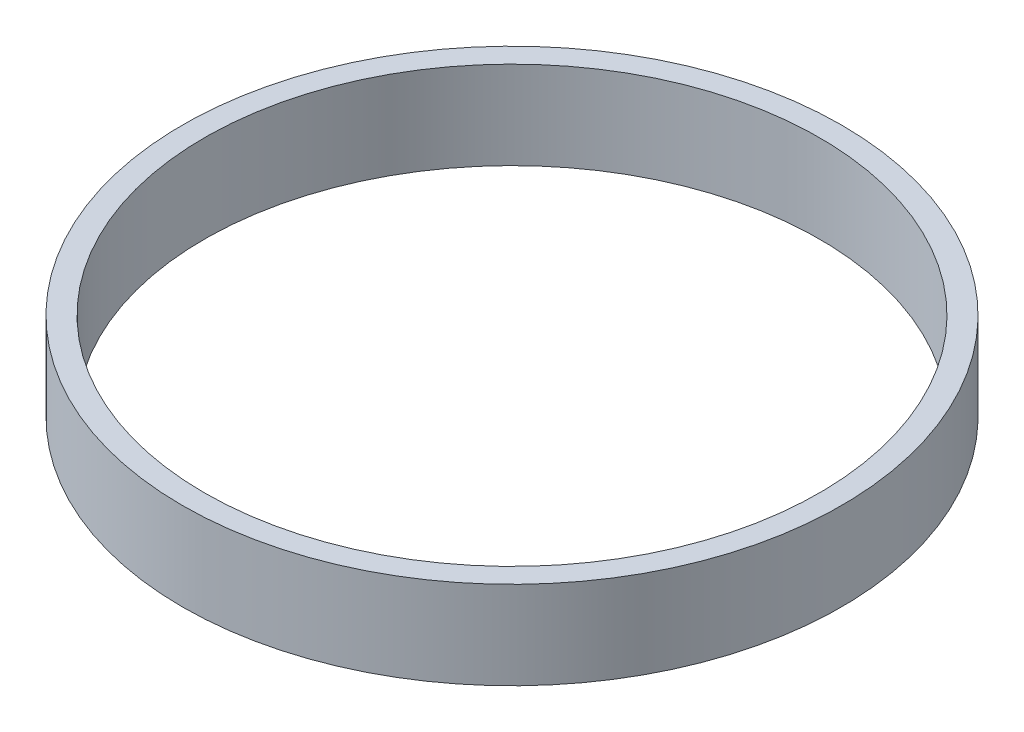
ISO-10303-21;
HEADER;
FILE_DESCRIPTION(('STEP AP214'),'2;1');
FILE_NAME('part.step','',(''),(''),'','','');
FILE_SCHEMA(('AUTOMOTIVE_DESIGN { 1 0 10303 214 1 1 1 1 }'));
ENDSEC;
DATA;
#1=APPLICATION_CONTEXT('core data for automotive mechanical design processes');
#2=APPLICATION_PROTOCOL_DEFINITION('international standard','automotive_design',2000,#1);
#3=PRODUCT_CONTEXT('',#1,'mechanical');
#4=PRODUCT('Part','Part','',(#3));
#5=PRODUCT_RELATED_PRODUCT_CATEGORY('part','',(#4));
#6=PRODUCT_DEFINITION_FORMATION('','',#4);
#7=PRODUCT_DEFINITION_CONTEXT('part definition',#1,'design');
#8=PRODUCT_DEFINITION('design','',#6,#7);
#9=PRODUCT_DEFINITION_SHAPE('','',#8);
#10=(LENGTH_UNIT() NAMED_UNIT(*) SI_UNIT(.MILLI.,.METRE.));
#11=(NAMED_UNIT(*) PLANE_ANGLE_UNIT() SI_UNIT($,.RADIAN.));
#12=(NAMED_UNIT(*) SI_UNIT($,.STERADIAN.) SOLID_ANGLE_UNIT());
#13=UNCERTAINTY_MEASURE_WITH_UNIT(LENGTH_MEASURE(1.E-05),#10,'distance_accuracy_value','');
#14=(GEOMETRIC_REPRESENTATION_CONTEXT(3) GLOBAL_UNCERTAINTY_ASSIGNED_CONTEXT((#13)) GLOBAL_UNIT_ASSIGNED_CONTEXT((#10,
#11,#12)) REPRESENTATION_CONTEXT('',''));
#15=CARTESIAN_POINT('',(0.,0.,0.));
#16=DIRECTION('',(0.,0.,1.));
#17=DIRECTION('',(1.,0.,0.));
#18=AXIS2_PLACEMENT_3D('',#15,#16,#17);
#19=CARTESIAN_POINT('',(0.,10.,0.));
#20=DIRECTION('',(0.,1.,0.));
#21=DIRECTION('',(0.,0.,1.));
#22=AXIS2_PLACEMENT_3D('',#19,#20,#21);
#23=PLANE('',#22);
#24=CARTESIAN_POINT('',(0.,10.,0.));
#25=DIRECTION('',(0.,1.,0.));
#26=DIRECTION('',(0.,0.,1.));
#27=AXIS2_PLACEMENT_3D('',#24,#25,#26);
#28=CIRCLE('',#27,37.5);
#29=CARTESIAN_POINT('',(0.,10.,37.5));
#30=VERTEX_POINT('',#29);
#31=EDGE_CURVE('E10',#30,#30,#28,.T.);
#32=ORIENTED_EDGE('',*,*,#31,.T.);
#33=EDGE_LOOP('',(#32));
#34=FACE_BOUND('',#33,.T.);
#35=CARTESIAN_POINT('',(0.,10.,0.));
#36=DIRECTION('',(0.,1.,0.));
#37=DIRECTION('',(0.,0.,1.));
#38=AXIS2_PLACEMENT_3D('',#35,#36,#37);
#39=CIRCLE('',#38,35.);
#40=CARTESIAN_POINT('',(0.,10.,35.));
#41=VERTEX_POINT('',#40);
#42=EDGE_CURVE('E43',#41,#41,#39,.T.);
#43=ORIENTED_EDGE('',*,*,#42,.F.);
#44=EDGE_LOOP('',(#43));
#45=FACE_BOUND('',#44,.T.);
#46=ADVANCED_FACE('F32',(#34,#45),#23,.T.);
#47=CARTESIAN_POINT('',(0.,0.,0.));
#48=DIRECTION('',(0.,1.,0.));
#49=DIRECTION('',(0.,0.,1.));
#50=AXIS2_PLACEMENT_3D('',#47,#48,#49);
#51=PLANE('',#50);
#52=CARTESIAN_POINT('',(0.,0.,0.));
#53=DIRECTION('',(0.,1.,0.));
#54=DIRECTION('',(0.,0.,1.));
#55=AXIS2_PLACEMENT_3D('',#52,#53,#54);
#56=CIRCLE('',#55,37.5);
#57=CARTESIAN_POINT('',(0.,0.,37.5));
#58=VERTEX_POINT('',#57);
#59=EDGE_CURVE('E36',#58,#58,#56,.T.);
#60=ORIENTED_EDGE('',*,*,#59,.F.);
#61=EDGE_LOOP('',(#60));
#62=FACE_BOUND('',#61,.T.);
#63=CARTESIAN_POINT('',(0.,0.,0.));
#64=DIRECTION('',(0.,1.,0.));
#65=DIRECTION('',(0.,0.,1.));
#66=AXIS2_PLACEMENT_3D('',#63,#64,#65);
#67=CIRCLE('',#66,35.);
#68=CARTESIAN_POINT('',(0.,0.,35.));
#69=VERTEX_POINT('',#68);
#70=EDGE_CURVE('E45',#69,#69,#67,.T.);
#71=ORIENTED_EDGE('',*,*,#70,.T.);
#72=EDGE_LOOP('',(#71));
#73=FACE_BOUND('',#72,.T.);
#74=ADVANCED_FACE('F55',(#62,#73),#51,.F.);
#75=CARTESIAN_POINT('',(0.,10.,0.));
#76=DIRECTION('',(0.,-1.,0.));
#77=DIRECTION('',(0.,0.,-1.));
#78=AXIS2_PLACEMENT_3D('',#75,#76,#77);
#79=CYLINDRICAL_SURFACE('',#78,37.5);
#80=ORIENTED_EDGE('',*,*,#31,.F.);
#81=EDGE_LOOP('',(#80));
#82=FACE_BOUND('',#81,.T.);
#83=ORIENTED_EDGE('',*,*,#59,.T.);
#84=EDGE_LOOP('',(#83));
#85=FACE_BOUND('',#84,.T.);
#86=ADVANCED_FACE('F34',(#82,#85),#79,.T.);
#87=CARTESIAN_POINT('',(0.,10.,0.));
#88=DIRECTION('',(0.,-1.,0.));
#89=DIRECTION('',(0.,0.,-1.));
#90=AXIS2_PLACEMENT_3D('',#87,#88,#89);
#91=CYLINDRICAL_SURFACE('',#90,35.);
#92=ORIENTED_EDGE('',*,*,#42,.T.);
#93=EDGE_LOOP('',(#92));
#94=FACE_BOUND('',#93,.T.);
#95=ORIENTED_EDGE('',*,*,#70,.F.);
#96=EDGE_LOOP('',(#95));
#97=FACE_BOUND('',#96,.T.);
#98=ADVANCED_FACE('F51',(#94,#97),#91,.F.);
#99=CLOSED_SHELL('',(#46,#74,#86,#98));
#100=MANIFOLD_SOLID_BREP('B2',#99);
#101=ADVANCED_BREP_SHAPE_REPRESENTATION('',(#18,#100),#14);
#102=SHAPE_DEFINITION_REPRESENTATION(#9,#101);
ENDSEC;
END-ISO-10303-21;
